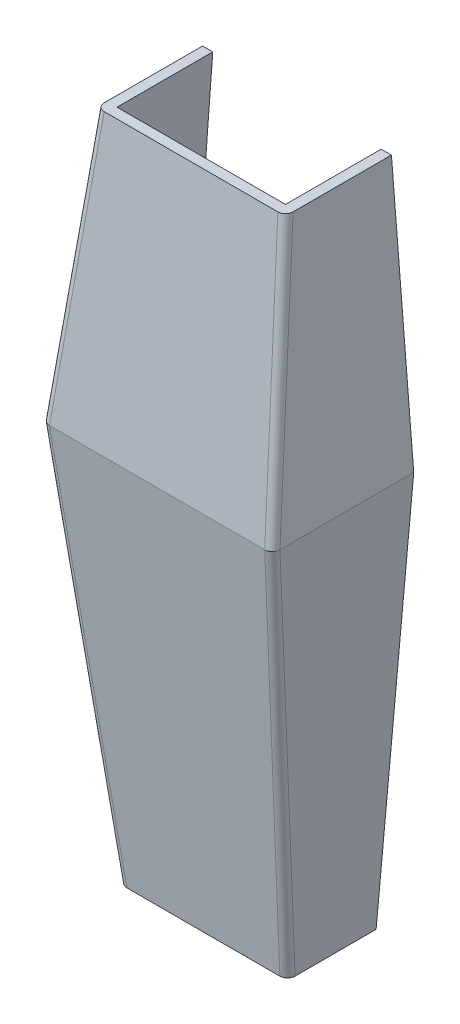
ISO-10303-21;
HEADER;
FILE_DESCRIPTION(('STEP AP214'),'2;1');
FILE_NAME('part.step','',(''),(''),'','','');
FILE_SCHEMA(('AUTOMOTIVE_DESIGN { 1 0 10303 214 1 1 1 1 }'));
ENDSEC;
DATA;
#1=APPLICATION_CONTEXT('core data for automotive mechanical design processes');
#2=APPLICATION_PROTOCOL_DEFINITION('international standard','automotive_design',2000,#1);
#3=PRODUCT_CONTEXT('',#1,'mechanical');
#4=PRODUCT('Part','Part','',(#3));
#5=PRODUCT_RELATED_PRODUCT_CATEGORY('part','',(#4));
#6=PRODUCT_DEFINITION_FORMATION('','',#4);
#7=PRODUCT_DEFINITION_CONTEXT('part definition',#1,'design');
#8=PRODUCT_DEFINITION('design','',#6,#7);
#9=PRODUCT_DEFINITION_SHAPE('','',#8);
#10=(LENGTH_UNIT() NAMED_UNIT(*) SI_UNIT(.MILLI.,.METRE.));
#11=(NAMED_UNIT(*) PLANE_ANGLE_UNIT() SI_UNIT($,.RADIAN.));
#12=(NAMED_UNIT(*) SI_UNIT($,.STERADIAN.) SOLID_ANGLE_UNIT());
#13=UNCERTAINTY_MEASURE_WITH_UNIT(LENGTH_MEASURE(1.E-05),#10,'distance_accuracy_value','');
#14=(GEOMETRIC_REPRESENTATION_CONTEXT(3) GLOBAL_UNCERTAINTY_ASSIGNED_CONTEXT((#13)) GLOBAL_UNIT_ASSIGNED_CONTEXT((#10,
#11,#12)) REPRESENTATION_CONTEXT('',''));
#15=CARTESIAN_POINT('',(0.,0.,0.));
#16=DIRECTION('',(0.,0.,1.));
#17=DIRECTION('',(1.,0.,0.));
#18=AXIS2_PLACEMENT_3D('',#15,#16,#17);
#19=CARTESIAN_POINT('',(0.,52.,0.));
#20=DIRECTION('',(0.,-1.,0.));
#21=DIRECTION('',(0.,0.,-1.));
#22=AXIS2_PLACEMENT_3D('',#19,#20,#21);
#23=PLANE('',#22);
#24=DIRECTION('',(1.,0.,0.));
#25=VECTOR('',#24,1.);
#26=CARTESIAN_POINT('',(-18.5188755077592,52.,8.99422683165892));
#27=LINE('',#26,#25);
#28=CARTESIAN_POINT('',(-17.0291924911233,52.,8.99422683165892));
#29=VERTEX_POINT('',#28);
#30=CARTESIAN_POINT('',(17.0291924911233,52.,8.99422683165892));
#31=VERTEX_POINT('',#30);
#32=EDGE_CURVE('E316',#29,#31,#27,.T.);
#33=ORIENTED_EDGE('',*,*,#32,.T.);
#34=CARTESIAN_POINT('',(17.0142688989289,52.,7.48201110743316));
#35=DIRECTION('',(0.,-1.,0.));
#36=DIRECTION('',(0.52281566203321,0.,0.852445765742769));
#37=AXIS2_PLACEMENT_3D('',#34,#35,#36);
#38=ELLIPSE('',#37,1.51678523329158,1.5);
#39=CARTESIAN_POINT('',(18.5188755077592,52.,7.49701017140502));
#40=VERTEX_POINT('',#39);
#41=EDGE_CURVE('E63',#31,#40,#38,.F.);
#42=ORIENTED_EDGE('',*,*,#41,.T.);
#43=DIRECTION('',(0.,0.,-1.));
#44=VECTOR('',#43,1.);
#45=CARTESIAN_POINT('',(18.5188755077592,52.,8.99422683165892));
#46=LINE('',#45,#44);
#47=CARTESIAN_POINT('',(18.5188755077592,52.,-11.7887815558452));
#48=VERTEX_POINT('',#47);
#49=EDGE_CURVE('E57',#40,#48,#46,.T.);
#50=ORIENTED_EDGE('',*,*,#49,.T.);
#51=DIRECTION('',(-1.,0.,0.));
#52=VECTOR('',#51,1.);
#53=CARTESIAN_POINT('',(-18.5188755077592,52.,-11.7887815558452));
#54=LINE('',#53,#52);
#55=CARTESIAN_POINT('',(16.5127333626522,52.,-11.7887815558452));
#56=VERTEX_POINT('',#55);
#57=EDGE_CURVE('E581',#48,#56,#54,.T.);
#58=ORIENTED_EDGE('',*,*,#57,.T.);
#59=DIRECTION('',(0.,0.,-1.));
#60=VECTOR('',#59,1.);
#61=CARTESIAN_POINT('',(16.5127333626522,52.,0.));
#62=LINE('',#61,#60);
#63=CARTESIAN_POINT('',(16.5127333626522,52.,6.97793919935791));
#64=VERTEX_POINT('',#63);
#65=EDGE_CURVE('E205',#64,#56,#62,.T.);
#66=ORIENTED_EDGE('',*,*,#65,.F.);
#67=DIRECTION('',(1.,0.,0.));
#68=VECTOR('',#67,1.);
#69=CARTESIAN_POINT('',(0.,52.,6.97793919935791));
#70=LINE('',#69,#68);
#71=CARTESIAN_POINT('',(-16.5127333626522,52.,6.97793919935791));
#72=VERTEX_POINT('',#71);
#73=EDGE_CURVE('E204',#72,#64,#70,.T.);
#74=ORIENTED_EDGE('',*,*,#73,.F.);
#75=DIRECTION('',(0.,0.,1.));
#76=VECTOR('',#75,1.);
#77=CARTESIAN_POINT('',(-16.5127333626522,52.,0.));
#78=LINE('',#77,#76);
#79=CARTESIAN_POINT('',(-16.5127333626522,52.,-11.7887815558452));
#80=VERTEX_POINT('',#79);
#81=EDGE_CURVE('E235',#80,#72,#78,.T.);
#82=ORIENTED_EDGE('',*,*,#81,.F.);
#83=CARTESIAN_POINT('',(-18.5188755077592,52.,-11.7887815558452));
#84=VERTEX_POINT('',#83);
#85=EDGE_CURVE('E368',#80,#84,#54,.T.);
#86=ORIENTED_EDGE('',*,*,#85,.T.);
#87=DIRECTION('',(0.,0.,1.));
#88=VECTOR('',#87,1.);
#89=CARTESIAN_POINT('',(-18.5188755077592,52.,8.99422683165892));
#90=LINE('',#89,#88);
#91=CARTESIAN_POINT('',(-18.5188755077592,52.,7.49701017140502));
#92=VERTEX_POINT('',#91);
#93=EDGE_CURVE('E577',#84,#92,#90,.T.);
#94=ORIENTED_EDGE('',*,*,#93,.T.);
#95=CARTESIAN_POINT('',(-17.0142688989289,52.,7.48201110743316));
#96=DIRECTION('',(0.,-1.,0.));
#97=DIRECTION('',(-0.52281566203321,0.,0.85244576574277));
#98=AXIS2_PLACEMENT_3D('',#95,#96,#97);
#99=ELLIPSE('',#98,1.51678523329158,1.5);
#100=EDGE_CURVE('E497',#92,#29,#99,.F.);
#101=ORIENTED_EDGE('',*,*,#100,.T.);
#102=EDGE_LOOP('',(#33,#42,#50,#58,#66,#74,#82,#86,#94,#101));
#103=FACE_BOUND('',#102,.T.);
#104=ADVANCED_FACE('F52',(#103),#23,.F.);
#105=CARTESIAN_POINT('',(0.,0.0676591543403054,-12.0796588325334));
#106=DIRECTION('',(0.,0.0056009937033721,-0.999984314311747));
#107=DIRECTION('',(0.,0.999984314311747,0.0056009937033721));
#108=AXIS2_PLACEMENT_3D('',#105,#106,#107);
#109=PLANE('',#108);
#110=ORIENTED_EDGE('',*,*,#85,.F.);
#111=DIRECTION('',(-0.0781906352049779,-0.996922787999062,-0.00558384584479609));
#112=VECTOR('',#111,1.);
#113=CARTESIAN_POINT('',(-20.460032538833,1.67232981969582,-12.0706709412595));
#114=LINE('',#113,#112);
#115=CARTESIAN_POINT('',(-20.5913000880713,-0.00045936157015178,-12.0800305192456));
#116=VERTEX_POINT('',#115);
#117=EDGE_CURVE('E212',#80,#116,#114,.T.);
#118=ORIENTED_EDGE('',*,*,#117,.T.);
#119=DIRECTION('',(-1.,0.,0.));
#120=VECTOR('',#119,1.);
#121=CARTESIAN_POINT('',(-22.5973388347132,0.,-12.0800377969752));
#122=LINE('',#121,#120);
#123=CARTESIAN_POINT('',(-22.5973388347132,0.,-12.0800377969752));
#124=VERTEX_POINT('',#123);
#125=EDGE_CURVE('E424',#116,#124,#122,.T.);
#126=ORIENTED_EDGE('',*,*,#125,.T.);
#127=DIRECTION('',(-0.0781906352049779,-0.996922787999062,-0.00558384584479609));
#128=VECTOR('',#127,1.);
#129=CARTESIAN_POINT('',(-18.5188755077592,52.,-11.7887815558452));
#130=LINE('',#129,#128);
#131=EDGE_CURVE('E673',#84,#124,#130,.T.);
#132=ORIENTED_EDGE('',*,*,#131,.F.);
#133=EDGE_LOOP('',(#110,#118,#126,#132));
#134=FACE_BOUND('',#133,.T.);
#135=ADVANCED_FACE('F335',(#134),#109,.T.);
#136=CARTESIAN_POINT('',(0.,-80.,0.));
#137=DIRECTION('',(0.,-1.,0.));
#138=DIRECTION('',(0.,0.,-1.));
#139=AXIS2_PLACEMENT_3D('',#136,#137,#138);
#140=PLANE('',#139);
#141=DIRECTION('',(1.,0.,0.));
#142=VECTOR('',#141,1.);
#143=CARTESIAN_POINT('',(-16.4895732274601,-80.,6.57189908788443));
#144=LINE('',#143,#142);
#145=CARTESIAN_POINT('',(-14.9981121668629,-80.,6.57189908788443));
#146=VERTEX_POINT('',#145);
#147=CARTESIAN_POINT('',(14.9981121668629,-80.,6.57189908788443));
#148=VERTEX_POINT('',#147);
#149=EDGE_CURVE('E461',#146,#148,#144,.T.);
#150=ORIENTED_EDGE('',*,*,#149,.F.);
#151=CARTESIAN_POINT('',(-14.9852079230873,-80.,5.06228475793314));
#152=DIRECTION('',(0.,-1.,0.));
#153=DIRECTION('',(-0.55846839253135,0.,0.829525801011307));
#154=AXIS2_PLACEMENT_3D('',#151,#152,#153);
#155=ELLIPSE('',#154,1.51395191277496,1.5);
#156=CARTESIAN_POINT('',(-16.4895732274601,-80.,5.07523402714601));
#157=VERTEX_POINT('',#156);
#158=EDGE_CURVE('E609',#146,#157,#155,.T.);
#159=ORIENTED_EDGE('',*,*,#158,.T.);
#160=DIRECTION('',(0.,0.,1.));
#161=VECTOR('',#160,1.);
#162=CARTESIAN_POINT('',(-16.4895732274601,-80.,6.57189908788443));
#163=LINE('',#162,#161);
#164=CARTESIAN_POINT('',(-16.4895732274601,-80.,-10.8125866142183));
#165=VERTEX_POINT('',#164);
#166=EDGE_CURVE('E466',#165,#157,#163,.T.);
#167=ORIENTED_EDGE('',*,*,#166,.F.);
#168=DIRECTION('',(-1.,0.,0.));
#169=VECTOR('',#168,1.);
#170=CARTESIAN_POINT('',(-16.4895732274601,-80.,-10.8125866142183));
#171=LINE('',#170,#169);
#172=CARTESIAN_POINT('',(-14.4837528216297,-80.,-10.8125866142183));
#173=VERTEX_POINT('',#172);
#174=EDGE_CURVE('E669',#173,#165,#171,.T.);
#175=ORIENTED_EDGE('',*,*,#174,.F.);
#176=DIRECTION('',(0.,0.,1.));
#177=VECTOR('',#176,1.);
#178=CARTESIAN_POINT('',(-14.4837528216297,-80.,0.));
#179=LINE('',#178,#177);
#180=CARTESIAN_POINT('',(-14.4837528216297,-80.,4.55907998128272));
#181=VERTEX_POINT('',#180);
#182=EDGE_CURVE('E244',#173,#181,#179,.T.);
#183=ORIENTED_EDGE('',*,*,#182,.T.);
#184=DIRECTION('',(1.,0.,0.));
#185=VECTOR('',#184,1.);
#186=CARTESIAN_POINT('',(0.,-80.,4.55907998128272));
#187=LINE('',#186,#185);
#188=CARTESIAN_POINT('',(14.4837528216297,-80.,4.55907998128272));
#189=VERTEX_POINT('',#188);
#190=EDGE_CURVE('E186',#181,#189,#187,.T.);
#191=ORIENTED_EDGE('',*,*,#190,.T.);
#192=DIRECTION('',(0.,0.,-1.));
#193=VECTOR('',#192,1.);
#194=CARTESIAN_POINT('',(14.4837528216297,-80.,0.));
#195=LINE('',#194,#193);
#196=CARTESIAN_POINT('',(14.4837528216297,-80.,-10.8125866142183));
#197=VERTEX_POINT('',#196);
#198=EDGE_CURVE('E192',#189,#197,#195,.T.);
#199=ORIENTED_EDGE('',*,*,#198,.T.);
#200=CARTESIAN_POINT('',(16.4895732274601,-80.,-10.8125866142183));
#201=VERTEX_POINT('',#200);
#202=EDGE_CURVE('E667',#201,#197,#171,.T.);
#203=ORIENTED_EDGE('',*,*,#202,.F.);
#204=DIRECTION('',(0.,0.,-1.));
#205=VECTOR('',#204,1.);
#206=CARTESIAN_POINT('',(16.4895732274601,-80.,6.57189908788443));
#207=LINE('',#206,#205);
#208=CARTESIAN_POINT('',(16.4895732274601,-80.,5.07523402714601));
#209=VERTEX_POINT('',#208);
#210=EDGE_CURVE('E467',#209,#201,#207,.T.);
#211=ORIENTED_EDGE('',*,*,#210,.F.);
#212=CARTESIAN_POINT('',(14.9852079230873,-80.,5.06228475793315));
#213=DIRECTION('',(0.,-1.,0.));
#214=DIRECTION('',(0.558468392531351,0.,0.829525801011306));
#215=AXIS2_PLACEMENT_3D('',#212,#213,#214);
#216=ELLIPSE('',#215,1.51395191277496,1.5);
#217=EDGE_CURVE('E611',#209,#148,#216,.T.);
#218=ORIENTED_EDGE('',*,*,#217,.T.);
#219=EDGE_LOOP('',(#150,#159,#167,#175,#183,#191,#199,#203,#211,#218));
#220=FACE_BOUND('',#219,.T.);
#221=ADVANCED_FACE('F637',(#220),#140,.T.);
#222=CARTESIAN_POINT('',(0.,-0.191337700684521,-12.0770064070372));
#223=DIRECTION('',(0.,0.0158411518044274,0.999874521082275));
#224=DIRECTION('',(0.,-0.999874521082275,0.0158411518044274));
#225=AXIS2_PLACEMENT_3D('',#222,#223,#224);
#226=PLANE('',#225);
#227=DIRECTION('',(-0.0761160325494471,0.996973851898427,-0.0157951960970792));
#228=VECTOR('',#227,1.);
#229=CARTESIAN_POINT('',(-20.4576949308948,-1.75283082676267,-12.0522674531683));
#230=LINE('',#229,#228);
#231=EDGE_CURVE('E228',#173,#116,#230,.T.);
#232=ORIENTED_EDGE('',*,*,#231,.F.);
#233=ORIENTED_EDGE('',*,*,#174,.T.);
#234=DIRECTION('',(-0.076116032549447,0.996973851898427,-0.0157951960970792));
#235=VECTOR('',#234,1.);
#236=CARTESIAN_POINT('',(-16.4895732274601,-80.,-10.8125866142183));
#237=LINE('',#236,#235);
#238=EDGE_CURVE('E889',#165,#124,#237,.T.);
#239=ORIENTED_EDGE('',*,*,#238,.T.);
#240=ORIENTED_EDGE('',*,*,#125,.F.);
#241=EDGE_LOOP('',(#232,#233,#239,#240));
#242=FACE_BOUND('',#241,.T.);
#243=ADVANCED_FACE('F646',(#242),#226,.F.);
#244=CARTESIAN_POINT('',(0.,1.96841909915263,15.3923944347321));
#245=DIRECTION('',(0.,0.126849539789616,0.991921969841964));
#246=DIRECTION('',(0.,-0.991921969841964,0.126849539789616));
#247=AXIS2_PLACEMENT_3D('',#244,#245,#246);
#248=PLANE('',#247);
#249=CARTESIAN_POINT('',(21.5706429368671,6.25655190119919,14.8440169523955));
#250=DIRECTION('',(0.,0.126849539789616,0.991921969841964));
#251=DIRECTION('',(0.0778643538226336,0.988910457484795,-0.126464419822328));
#252=AXIS2_PLACEMENT_3D('',#249,#250,#251);
#253=ELLIPSE('',#252,6.32562749447484,1.5);
#254=CARTESIAN_POINT('',(21.1058777741159,0.,15.6441209459217));
#255=VERTEX_POINT('',#254);
#256=CARTESIAN_POINT('',(21.1076558180773,0.,15.6441209459217));
#257=VERTEX_POINT('',#256);
#258=EDGE_CURVE('E553',#255,#257,#253,.T.);
#259=ORIENTED_EDGE('',*,*,#258,.T.);
#260=DIRECTION('',(0.0775640334590426,-0.988933678332855,0.126467389364268));
#261=VECTOR('',#260,1.);
#262=CARTESIAN_POINT('',(20.8272101750519,3.57565393341664,15.1868570988743));
#263=LINE('',#262,#261);
#264=EDGE_CURVE('E573',#257,#31,#263,.F.);
#265=ORIENTED_EDGE('',*,*,#264,.T.);
#266=ORIENTED_EDGE('',*,*,#32,.F.);
#267=DIRECTION('',(-0.0775640334590425,-0.988933678332855,0.126467389364268));
#268=VECTOR('',#267,1.);
#269=CARTESIAN_POINT('',(-20.8272101750519,3.57565393341664,15.1868570988743));
#270=LINE('',#269,#268);
#271=CARTESIAN_POINT('',(-21.1076558180773,0.,15.6441209459217));
#272=VERTEX_POINT('',#271);
#273=EDGE_CURVE('E554',#29,#272,#270,.T.);
#274=ORIENTED_EDGE('',*,*,#273,.T.);
#275=CARTESIAN_POINT('',(-21.5706429368671,6.2565519011992,14.8440169523955));
#276=DIRECTION('',(0.,0.126849539789616,0.991921969841964));
#277=DIRECTION('',(-0.0778643538226335,0.988910457484795,-0.126464419822328));
#278=AXIS2_PLACEMENT_3D('',#275,#276,#277);
#279=ELLIPSE('',#278,6.32562749447484,1.5);
#280=CARTESIAN_POINT('',(-21.1058777741159,0.,15.6441209459217));
#281=VERTEX_POINT('',#280);
#282=EDGE_CURVE('E546',#272,#281,#279,.T.);
#283=ORIENTED_EDGE('',*,*,#282,.T.);
#284=DIRECTION('',(1.,0.,0.));
#285=VECTOR('',#284,1.);
#286=CARTESIAN_POINT('',(-22.5973388347132,0.,15.6441209459217));
#287=LINE('',#286,#285);
#288=EDGE_CURVE('E309',#281,#255,#287,.T.);
#289=ORIENTED_EDGE('',*,*,#288,.T.);
#290=EDGE_LOOP('',(#259,#265,#266,#274,#283,#289));
#291=FACE_BOUND('',#290,.T.);
#292=ADVANCED_FACE('F338',(#291),#248,.T.);
#293=CARTESIAN_POINT('',(22.4591794719602,1.76151807365128,0.));
#294=DIRECTION('',(0.996938330057005,0.0781918541994653,0.));
#295=DIRECTION('',(-0.0781918541994654,0.996938330057005,0.));
#296=AXIS2_PLACEMENT_3D('',#293,#294,#295);
#297=PLANE('',#296);
#298=ORIENTED_EDGE('',*,*,#49,.F.);
#299=DIRECTION('',(0.0775640334590426,-0.988933678332855,0.126467389364268));
#300=VECTOR('',#299,1.);
#301=CARTESIAN_POINT('',(22.3226176701374,3.50266740503142,13.6989741441113));
#302=LINE('',#301,#300);
#303=CARTESIAN_POINT('',(22.5973388347132,0.,14.1469042856678));
#304=VERTEX_POINT('',#303);
#305=EDGE_CURVE('E848',#40,#304,#302,.T.);
#306=ORIENTED_EDGE('',*,*,#305,.T.);
#307=DIRECTION('',(0.,0.,-1.));
#308=VECTOR('',#307,1.);
#309=CARTESIAN_POINT('',(22.5973388347132,0.,15.6441209459217));
#310=LINE('',#309,#308);
#311=CARTESIAN_POINT('',(22.5973388347132,0.,-12.0800377969752));
#312=VERTEX_POINT('',#311);
#313=EDGE_CURVE('E465',#304,#312,#310,.T.);
#314=ORIENTED_EDGE('',*,*,#313,.T.);
#315=DIRECTION('',(0.078190635204978,-0.996922787999062,-0.00558384584479609));
#316=VECTOR('',#315,1.);
#317=CARTESIAN_POINT('',(18.5188755077592,52.,-11.7887815558452));
#318=LINE('',#317,#316);
#319=EDGE_CURVE('E386',#48,#312,#318,.T.);
#320=ORIENTED_EDGE('',*,*,#319,.F.);
#321=EDGE_LOOP('',(#298,#306,#314,#320));
#322=FACE_BOUND('',#321,.T.);
#323=ADVANCED_FACE('F707',(#322),#297,.T.);
#324=CARTESIAN_POINT('',(-22.4591794719602,1.76151807365128,0.));
#325=DIRECTION('',(-0.996938330057005,0.0781918541994653,0.));
#326=DIRECTION('',(-0.0781918541994653,-0.996938330057005,0.));
#327=AXIS2_PLACEMENT_3D('',#324,#325,#326);
#328=PLANE('',#327);
#329=DIRECTION('',(0.,0.,1.));
#330=VECTOR('',#329,1.);
#331=CARTESIAN_POINT('',(-22.5973388347132,0.,15.6441209459217));
#332=LINE('',#331,#330);
#333=CARTESIAN_POINT('',(-22.5973388347132,0.,14.1469042856678));
#334=VERTEX_POINT('',#333);
#335=EDGE_CURVE('E446',#124,#334,#332,.T.);
#336=ORIENTED_EDGE('',*,*,#335,.T.);
#337=DIRECTION('',(-0.0775640334590425,-0.988933678332855,0.126467389364268));
#338=VECTOR('',#337,1.);
#339=CARTESIAN_POINT('',(-22.3226176701374,3.50266740503141,13.6989741441113));
#340=LINE('',#339,#338);
#341=EDGE_CURVE('E12',#334,#92,#340,.F.);
#342=ORIENTED_EDGE('',*,*,#341,.T.);
#343=ORIENTED_EDGE('',*,*,#93,.F.);
#344=ORIENTED_EDGE('',*,*,#131,.T.);
#345=EDGE_LOOP('',(#336,#342,#343,#344));
#346=FACE_BOUND('',#345,.T.);
#347=ADVANCED_FACE('F399',(#346),#328,.T.);
#348=DIRECTION('',(0.0781906352049779,-0.996922787999062,-0.00558384584479608));
#349=VECTOR('',#348,1.);
#350=CARTESIAN_POINT('',(20.460032538833,1.67232981969582,-12.0706709412595));
#351=LINE('',#350,#349);
#352=CARTESIAN_POINT('',(20.5913000880713,-0.000459361570151871,-12.0800305192456));
#353=VERTEX_POINT('',#352);
#354=EDGE_CURVE('E182',#56,#353,#351,.T.);
#355=ORIENTED_EDGE('',*,*,#354,.F.);
#356=ORIENTED_EDGE('',*,*,#57,.F.);
#357=ORIENTED_EDGE('',*,*,#319,.T.);
#358=EDGE_CURVE('E376',#312,#353,#122,.T.);
#359=ORIENTED_EDGE('',*,*,#358,.T.);
#360=EDGE_LOOP('',(#355,#356,#357,#359));
#361=FACE_BOUND('',#360,.T.);
#362=ADVANCED_FACE('F389',(#361),#109,.T.);
#363=CARTESIAN_POINT('',(22.4663850818657,-1.71524267652902,0.));
#364=DIRECTION('',(-0.997098241789992,0.076125529353217,0.));
#365=DIRECTION('',(-0.076125529353217,-0.997098241789992,0.));
#366=AXIS2_PLACEMENT_3D('',#363,#364,#365);
#367=PLANE('',#366);
#368=ORIENTED_EDGE('',*,*,#313,.F.);
#369=CARTESIAN_POINT('',(21.8551692651325,-9.72099608667819,15.3750512728801));
#370=DIRECTION('',(-0.997098241789992,0.076125529353217,0.));
#371=DIRECTION('',(-0.0754996619748789,-0.988900581059923,0.127966565246656));
#372=AXIS2_PLACEMENT_3D('',#369,#370,#371);
#373=ELLIPSE('',#372,9.82819907379263,1.5);
#374=CARTESIAN_POINT('',(22.5973388347132,0.,14.1474558851833));
#375=VERTEX_POINT('',#374);
#376=EDGE_CURVE('E485',#304,#375,#373,.F.);
#377=ORIENTED_EDGE('',*,*,#376,.T.);
#378=DIRECTION('',(0.0756434891819556,0.990784441264458,0.112357703308033));
#379=VECTOR('',#378,1.);
#380=CARTESIAN_POINT('',(22.3477972266839,-3.26851584131445,13.7767971244469));
#381=LINE('',#380,#379);
#382=EDGE_CURVE('E498',#375,#209,#381,.F.);
#383=ORIENTED_EDGE('',*,*,#382,.T.);
#384=ORIENTED_EDGE('',*,*,#210,.T.);
#385=DIRECTION('',(0.0761160325494471,0.996973851898427,-0.0157951960970792));
#386=VECTOR('',#385,1.);
#387=CARTESIAN_POINT('',(16.4895732274601,-80.,-10.8125866142183));
#388=LINE('',#387,#386);
#389=EDGE_CURVE('E888',#201,#312,#388,.T.);
#390=ORIENTED_EDGE('',*,*,#389,.T.);
#391=EDGE_LOOP('',(#368,#377,#383,#384,#390));
#392=FACE_BOUND('',#391,.T.);
#393=ADVANCED_FACE('F281',(#392),#367,.F.);
#394=CARTESIAN_POINT('',(0.,-1.7515612907415,15.4454890380773));
#395=DIRECTION('',(0.,0.112680541290098,-0.993631267430011));
#396=DIRECTION('',(0.,0.993631267430011,0.112680541290098));
#397=AXIS2_PLACEMENT_3D('',#394,#395,#396);
#398=PLANE('',#397);
#399=ORIENTED_EDGE('',*,*,#288,.F.);
#400=DIRECTION('',(-0.0756434891819555,0.990784441264458,0.112357703308033));
#401=VECTOR('',#400,1.);
#402=CARTESIAN_POINT('',(-20.8521498639989,-3.32334835921977,15.2672440255919));
#403=LINE('',#402,#401);
#404=EDGE_CURVE('E608',#281,#146,#403,.F.);
#405=ORIENTED_EDGE('',*,*,#404,.T.);
#406=ORIENTED_EDGE('',*,*,#149,.T.);
#407=DIRECTION('',(0.0756434891819556,0.990784441264458,0.112357703308033));
#408=VECTOR('',#407,1.);
#409=CARTESIAN_POINT('',(20.8521498639989,-3.32334835921977,15.2672440255919));
#410=LINE('',#409,#408);
#411=EDGE_CURVE('E612',#148,#255,#410,.T.);
#412=ORIENTED_EDGE('',*,*,#411,.T.);
#413=EDGE_LOOP('',(#399,#405,#406,#412));
#414=FACE_BOUND('',#413,.T.);
#415=ADVANCED_FACE('F271',(#414),#398,.F.);
#416=ORIENTED_EDGE('',*,*,#202,.T.);
#417=DIRECTION('',(0.0761160325494472,0.996973851898427,-0.0157951960970792));
#418=VECTOR('',#417,1.);
#419=CARTESIAN_POINT('',(20.4576949308948,-1.75283082676267,-12.0522674531683));
#420=LINE('',#419,#418);
#421=EDGE_CURVE('E196',#197,#353,#420,.T.);
#422=ORIENTED_EDGE('',*,*,#421,.T.);
#423=ORIENTED_EDGE('',*,*,#358,.F.);
#424=ORIENTED_EDGE('',*,*,#389,.F.);
#425=EDGE_LOOP('',(#416,#422,#423,#424));
#426=FACE_BOUND('',#425,.T.);
#427=ADVANCED_FACE('F280',(#426),#226,.F.);
#428=CARTESIAN_POINT('',(-22.4663850818657,-1.71524267652902,0.));
#429=DIRECTION('',(0.997098241789992,0.0761255293532169,0.));
#430=DIRECTION('',(-0.0761255293532169,0.997098241789992,0.));
#431=AXIS2_PLACEMENT_3D('',#428,#429,#430);
#432=PLANE('',#431);
#433=ORIENTED_EDGE('',*,*,#166,.T.);
#434=DIRECTION('',(-0.0756434891819555,0.990784441264458,0.112357703308033));
#435=VECTOR('',#434,1.);
#436=CARTESIAN_POINT('',(-22.3477972266839,-3.26851584131445,13.7767971244469));
#437=LINE('',#436,#435);
#438=CARTESIAN_POINT('',(-22.5973388347132,0.,14.1474558851833));
#439=VERTEX_POINT('',#438);
#440=EDGE_CURVE('E579',#157,#439,#437,.T.);
#441=ORIENTED_EDGE('',*,*,#440,.T.);
#442=CARTESIAN_POINT('',(-21.8551692651325,-9.72099608667818,15.3750512728801));
#443=DIRECTION('',(0.997098241789992,0.0761255293532169,0.));
#444=DIRECTION('',(0.0754996619748789,-0.988900581059923,0.127966565246656));
#445=AXIS2_PLACEMENT_3D('',#442,#443,#444);
#446=ELLIPSE('',#445,9.82819907379264,1.5);
#447=EDGE_CURVE('E576',#439,#334,#446,.F.);
#448=ORIENTED_EDGE('',*,*,#447,.T.);
#449=ORIENTED_EDGE('',*,*,#335,.F.);
#450=ORIENTED_EDGE('',*,*,#238,.F.);
#451=EDGE_LOOP('',(#433,#441,#448,#449,#450));
#452=FACE_BOUND('',#451,.T.);
#453=ADVANCED_FACE('F336',(#452),#432,.F.);
#454=CARTESIAN_POINT('',(0.,1.7147200195734,13.4085504950482));
#455=DIRECTION('',(0.,0.126849539789616,0.991921969841964));
#456=DIRECTION('',(0.,-0.991921969841964,0.126849539789616));
#457=AXIS2_PLACEMENT_3D('',#454,#455,#456);
#458=PLANE('',#457);
#459=DIRECTION('',(-0.0775640334590425,-0.988933678332855,0.126467389364268));
#460=VECTOR('',#459,1.);
#461=CARTESIAN_POINT('',(-20.3336365695426,3.28386580180498,13.2078840854005));
#462=LINE('',#461,#460);
#463=CARTESIAN_POINT('',(-20.5908903252625,-0.0082269512040326,13.628885397359));
#464=VERTEX_POINT('',#463);
#465=EDGE_CURVE('E206',#72,#464,#462,.T.);
#466=ORIENTED_EDGE('',*,*,#465,.F.);
#467=ORIENTED_EDGE('',*,*,#73,.T.);
#468=DIRECTION('',(0.0775640334590426,-0.988933678332855,0.126467389364268));
#469=VECTOR('',#468,1.);
#470=CARTESIAN_POINT('',(20.3336365695426,3.28386580180498,13.2078840854005));
#471=LINE('',#470,#469);
#472=CARTESIAN_POINT('',(20.5908903252625,-0.00822695120403357,13.628885397359));
#473=VERTEX_POINT('',#472);
#474=EDGE_CURVE('E179',#64,#473,#471,.T.);
#475=ORIENTED_EDGE('',*,*,#474,.T.);
#476=DIRECTION('',(1.,0.,0.));
#477=VECTOR('',#476,1.);
#478=CARTESIAN_POINT('',(0.,-0.0143752020815454,13.6296716515383));
#479=LINE('',#478,#477);
#480=EDGE_CURVE('E201',#464,#473,#479,.T.);
#481=ORIENTED_EDGE('',*,*,#480,.F.);
#482=EDGE_LOOP('',(#466,#467,#475,#481));
#483=FACE_BOUND('',#482,.T.);
#484=ADVANCED_FACE('F200',(#483),#458,.F.);
#485=CARTESIAN_POINT('',(20.4653028118462,1.60513436525235,0.));
#486=DIRECTION('',(0.996938330057005,0.0781918541994653,0.));
#487=DIRECTION('',(-0.0781918541994654,0.996938330057005,0.));
#488=AXIS2_PLACEMENT_3D('',#485,#486,#487);
#489=PLANE('',#488);
#490=ORIENTED_EDGE('',*,*,#474,.F.);
#491=ORIENTED_EDGE('',*,*,#65,.T.);
#492=ORIENTED_EDGE('',*,*,#354,.T.);
#493=DIRECTION('',(0.,0.,-1.));
#494=VECTOR('',#493,1.);
#495=CARTESIAN_POINT('',(20.5913597262032,-0.00207870032651984,0.));
#496=LINE('',#495,#494);
#497=EDGE_CURVE('E175',#473,#353,#496,.T.);
#498=ORIENTED_EDGE('',*,*,#497,.F.);
#499=EDGE_LOOP('',(#490,#491,#492,#498));
#500=FACE_BOUND('',#499,.T.);
#501=ADVANCED_FACE('F177',(#500),#489,.F.);
#502=CARTESIAN_POINT('',(-20.4653028118462,1.60513436525235,0.));
#503=DIRECTION('',(-0.996938330057005,0.0781918541994653,0.));
#504=DIRECTION('',(-0.0781918541994653,-0.996938330057005,0.));
#505=AXIS2_PLACEMENT_3D('',#502,#503,#504);
#506=PLANE('',#505);
#507=ORIENTED_EDGE('',*,*,#117,.F.);
#508=ORIENTED_EDGE('',*,*,#81,.T.);
#509=ORIENTED_EDGE('',*,*,#465,.T.);
#510=DIRECTION('',(0.,0.,1.));
#511=VECTOR('',#510,1.);
#512=CARTESIAN_POINT('',(-20.5913597262032,-0.00207870032651984,0.));
#513=LINE('',#512,#511);
#514=EDGE_CURVE('E185',#116,#464,#513,.T.);
#515=ORIENTED_EDGE('',*,*,#514,.F.);
#516=EDGE_LOOP('',(#507,#508,#509,#515));
#517=FACE_BOUND('',#516,.T.);
#518=ADVANCED_FACE('F754',(#517),#506,.F.);
#519=CARTESIAN_POINT('',(20.4721885982857,-1.56299161782258,0.));
#520=DIRECTION('',(-0.997098241789992,0.076125529353217,0.));
#521=DIRECTION('',(-0.076125529353217,-0.997098241789992,0.));
#522=AXIS2_PLACEMENT_3D('',#519,#520,#521);
#523=PLANE('',#522);
#524=ORIENTED_EDGE('',*,*,#421,.F.);
#525=ORIENTED_EDGE('',*,*,#198,.F.);
#526=DIRECTION('',(0.0756434891819556,0.990784441264458,0.112357703308033));
#527=VECTOR('',#526,1.);
#528=CARTESIAN_POINT('',(20.3578408594352,-3.06072740145774,13.2842068639075));
#529=LINE('',#528,#527);
#530=EDGE_CURVE('E189',#189,#473,#529,.T.);
#531=ORIENTED_EDGE('',*,*,#530,.T.);
#532=ORIENTED_EDGE('',*,*,#497,.T.);
#533=EDGE_LOOP('',(#524,#525,#531,#532));
#534=FACE_BOUND('',#533,.T.);
#535=ADVANCED_FACE('F190',(#534),#523,.T.);
#536=CARTESIAN_POINT('',(0.,-1.5262002081613,13.4582265032172));
#537=DIRECTION('',(0.,0.112680541290098,-0.993631267430011));
#538=DIRECTION('',(0.,0.993631267430011,0.112680541290098));
#539=AXIS2_PLACEMENT_3D('',#536,#537,#538);
#540=PLANE('',#539);
#541=ORIENTED_EDGE('',*,*,#530,.F.);
#542=ORIENTED_EDGE('',*,*,#190,.F.);
#543=DIRECTION('',(-0.0756434891819555,0.990784441264458,0.112357703308033));
#544=VECTOR('',#543,1.);
#545=CARTESIAN_POINT('',(-20.3578408594352,-3.06072740145774,13.2842068639075));
#546=LINE('',#545,#544);
#547=EDGE_CURVE('E210',#181,#464,#546,.T.);
#548=ORIENTED_EDGE('',*,*,#547,.T.);
#549=ORIENTED_EDGE('',*,*,#480,.T.);
#550=EDGE_LOOP('',(#541,#542,#548,#549));
#551=FACE_BOUND('',#550,.T.);
#552=ADVANCED_FACE('F208',(#551),#540,.T.);
#553=CARTESIAN_POINT('',(-20.4721885982857,-1.56299161782258,0.));
#554=DIRECTION('',(0.997098241789992,0.0761255293532169,0.));
#555=DIRECTION('',(-0.0761255293532169,0.997098241789992,0.));
#556=AXIS2_PLACEMENT_3D('',#553,#554,#555);
#557=PLANE('',#556);
#558=ORIENTED_EDGE('',*,*,#547,.F.);
#559=ORIENTED_EDGE('',*,*,#182,.F.);
#560=ORIENTED_EDGE('',*,*,#231,.T.);
#561=ORIENTED_EDGE('',*,*,#514,.T.);
#562=EDGE_LOOP('',(#558,#559,#560,#561));
#563=FACE_BOUND('',#562,.T.);
#564=ADVANCED_FACE('F647',(#563),#557,.T.);
#565=CARTESIAN_POINT('',(-20.8272101750519,3.38537962373222,13.6989741441113));
#566=DIRECTION('',(-0.0775640334590425,-0.988933678332855,0.126467389364268));
#567=DIRECTION('',(0.,-0.126849539789616,-0.991921969841964));
#568=AXIS2_PLACEMENT_3D('',#565,#566,#567);
#569=CYLINDRICAL_SURFACE('',#568,1.5);
#570=ORIENTED_EDGE('',*,*,#341,.F.);
#571=ORIENTED_EDGE('',*,*,#447,.F.);
#572=CARTESIAN_POINT('',(-22.5973387853626,-6.46397492268195E-07,14.14745581188));
#573=CARTESIAN_POINT('',(-22.5973308185809,-9.75196907184661E-05,14.1898037529237));
#574=CARTESIAN_POINT('',(-22.5955495131469,-0.000149309161487672,14.2321318459891));
#575=CARTESIAN_POINT('',(-22.5884490416481,-0.000188854131629427,14.3164901961482));
#576=CARTESIAN_POINT('',(-22.5831298680072,-0.000176609493877319,14.3585204526041));
#577=CARTESIAN_POINT('',(-22.5618969750045,-8.31049678529187E-05,14.4836697467597));
#578=CARTESIAN_POINT('',(-22.5407078061515,5.48110923598974E-05,14.5659574001413));
#579=CARTESIAN_POINT('',(-22.4847738999457,0.000378705055900087,14.7258133522086));
#580=CARTESIAN_POINT('',(-22.4500193731905,0.000564717635148839,14.8033781958574));
#581=CARTESIAN_POINT('',(-22.3678978260998,0.000928104624078245,14.9515022064799));
#582=CARTESIAN_POINT('',(-22.3205347762321,0.00110548173233517,15.0220635692878));
#583=CARTESIAN_POINT('',(-22.2148859243069,0.00141250528669716,15.1536639409738));
#584=CARTESIAN_POINT('',(-22.1566777923741,0.00154247281790375,15.2147653302442));
#585=CARTESIAN_POINT('',(-22.0307581440161,0.00172908567726886,15.3262658959059));
#586=CARTESIAN_POINT('',(-21.9630449450712,0.00178571800596171,15.3766631735532));
#587=CARTESIAN_POINT('',(-21.8205089076968,0.00180364687616366,15.4650124431626));
#588=CARTESIAN_POINT('',(-21.7457310704636,0.00176551226660461,15.5030371515512));
#589=CARTESIAN_POINT('',(-21.5908665740004,0.00157604669805739,15.565972058465));
#590=CARTESIAN_POINT('',(-21.5107829760637,0.00142478050366109,15.5908897464877));
#591=CARTESIAN_POINT('',(-21.3764320145219,0.00106675536363404,15.6205998032061));
#592=CARTESIAN_POINT('',(-21.3230140130722,0.000898346489019778,15.629390059664));
#593=CARTESIAN_POINT('',(-21.2156232842647,0.000499520594021436,15.6411321893395));
#594=CARTESIAN_POINT('',(-21.1616515347976,0.000269199198327568,15.6440930079811));
#595=CARTESIAN_POINT('',(-21.1076554755597,4.36706522558098E-06,15.6441203874501));
#596=B_SPLINE_CURVE_WITH_KNOTS('',3,(#572,#573,#574,#575,#576,#577,#578,#579,#580,#581,#582,
#583,#584,#585,#586,#587,#588,#589,#590,#591,#592,#593,#594,#595),.UNSPECIFIED.,.F.,.F.,(4,2,2,
2,2,2,2,2,2,2,2,4),(0.,0.126967599470868,0.253935470834264,0.50754511059187,0.761338106418029,
1.01505127629084,1.26701276937874,1.51901891928243,1.76951603278559,2.01986985352734,
2.18198459771305,2.34385037811288),.UNSPECIFIED.);
#597=EDGE_CURVE('E229',#272,#439,#596,.F.);
#598=ORIENTED_EDGE('',*,*,#597,.F.);
#599=ORIENTED_EDGE('',*,*,#273,.F.);
#600=ORIENTED_EDGE('',*,*,#100,.F.);
#601=EDGE_LOOP('',(#570,#571,#598,#599,#600));
#602=FACE_BOUND('',#601,.T.);
#603=ADVANCED_FACE('F402',(#602),#569,.T.);
#604=CARTESIAN_POINT('',(-20.8521498639989,-3.15432754728463,13.7767971244469));
#605=DIRECTION('',(-0.0756434891819555,0.990784441264458,0.112357703308033));
#606=DIRECTION('',(0.,-0.112680541290098,0.993631267430011));
#607=AXIS2_PLACEMENT_3D('',#604,#605,#606);
#608=CYLINDRICAL_SURFACE('',#607,1.5);
#609=ORIENTED_EDGE('',*,*,#158,.F.);
#610=ORIENTED_EDGE('',*,*,#404,.F.);
#611=ORIENTED_EDGE('',*,*,#282,.F.);
#612=ORIENTED_EDGE('',*,*,#597,.T.);
#613=ORIENTED_EDGE('',*,*,#440,.F.);
#614=EDGE_LOOP('',(#609,#610,#611,#612,#613));
#615=FACE_BOUND('',#614,.T.);
#616=ADVANCED_FACE('F533',(#615),#608,.T.);
#617=CARTESIAN_POINT('',(20.8521498639989,-3.15432754728463,13.7767971244469));
#618=DIRECTION('',(0.0756434891819556,0.990784441264458,0.112357703308033));
#619=DIRECTION('',(0.,-0.112680541290098,0.993631267430011));
#620=AXIS2_PLACEMENT_3D('',#617,#618,#619);
#621=CYLINDRICAL_SURFACE('',#620,1.5);
#622=ORIENTED_EDGE('',*,*,#217,.F.);
#623=ORIENTED_EDGE('',*,*,#382,.F.);
#624=CARTESIAN_POINT('',(22.5973387853626,-6.46397514348726E-07,14.14745581188));
#625=CARTESIAN_POINT('',(22.5973308185809,-9.75196907543908E-05,14.1898037529237));
#626=CARTESIAN_POINT('',(22.5955495131469,-0.000149309161527892,14.2321318459891));
#627=CARTESIAN_POINT('',(22.5884490416481,-0.000188854131670101,14.3164901961482));
#628=CARTESIAN_POINT('',(22.5831298680072,-0.000176609493914153,14.3585204526041));
#629=CARTESIAN_POINT('',(22.5618969750045,-8.31049678824882E-05,14.4836697467597));
#630=CARTESIAN_POINT('',(22.5407078061515,5.48110923295197E-05,14.5659574001413));
#631=CARTESIAN_POINT('',(22.4847738999457,0.000378705055871408,14.7258133522086));
#632=CARTESIAN_POINT('',(22.4500193731905,0.000564717635122669,14.8033781958574));
#633=CARTESIAN_POINT('',(22.3678978260998,0.000928104624055066,14.9515022064799));
#634=CARTESIAN_POINT('',(22.3205347762321,0.00110548173231247,15.0220635692878));
#635=CARTESIAN_POINT('',(22.2148859243069,0.00141250528667692,15.1536639409738));
#636=CARTESIAN_POINT('',(22.1566777923741,0.00154247281788547,15.2147653302442));
#637=CARTESIAN_POINT('',(22.0307581440161,0.00172908567725413,15.3262658959059));
#638=CARTESIAN_POINT('',(21.9630449450712,0.00178571800594856,15.3766631735532));
#639=CARTESIAN_POINT('',(21.8205089076968,0.00180364687615269,15.4650124431626));
#640=CARTESIAN_POINT('',(21.7457310704636,0.00176551226659424,15.5030371515512));
#641=CARTESIAN_POINT('',(21.5908665740004,0.00157604669804961,15.565972058465));
#642=CARTESIAN_POINT('',(21.5107829760637,0.00142478050365529,15.5908897464877));
#643=CARTESIAN_POINT('',(21.3764320145219,0.00106675536362997,15.6205998032061));
#644=CARTESIAN_POINT('',(21.3230140130722,0.000898346489015987,15.629390059664));
#645=CARTESIAN_POINT('',(21.2156232842647,0.000499520594018893,15.6411321893395));
#646=CARTESIAN_POINT('',(21.1616515347976,0.000269199198325982,15.6440930079811));
#647=CARTESIAN_POINT('',(21.1076554755597,4.36706522601498E-06,15.6441203874501));
#648=B_SPLINE_CURVE_WITH_KNOTS('',3,(#624,#625,#626,#627,#628,#629,#630,#631,#632,#633,#634,
#635,#636,#637,#638,#639,#640,#641,#642,#643,#644,#645,#646,#647),.UNSPECIFIED.,.F.,.F.,(4,2,2,
2,2,2,2,2,2,2,2,4),(0.,0.126967599470869,0.253935470834267,0.507545110591874,0.761338106418033,
1.01505127629084,1.26701276937875,1.51901891928243,1.76951603278559,2.01986985352735,
2.18198459771305,2.34385037811289),.UNSPECIFIED.);
#649=EDGE_CURVE('E499',#257,#375,#648,.F.);
#650=ORIENTED_EDGE('',*,*,#649,.F.);
#651=ORIENTED_EDGE('',*,*,#258,.F.);
#652=ORIENTED_EDGE('',*,*,#411,.F.);
#653=EDGE_LOOP('',(#622,#623,#650,#651,#652));
#654=FACE_BOUND('',#653,.T.);
#655=ADVANCED_FACE('F536',(#654),#621,.T.);
#656=CARTESIAN_POINT('',(20.8272101750519,3.38537962373222,13.6989741441113));
#657=DIRECTION('',(0.0775640334590426,-0.988933678332855,0.126467389364268));
#658=DIRECTION('',(0.,-0.126849539789616,-0.991921969841964));
#659=AXIS2_PLACEMENT_3D('',#656,#657,#658);
#660=CYLINDRICAL_SURFACE('',#659,1.5);
#661=ORIENTED_EDGE('',*,*,#41,.F.);
#662=ORIENTED_EDGE('',*,*,#264,.F.);
#663=ORIENTED_EDGE('',*,*,#649,.T.);
#664=ORIENTED_EDGE('',*,*,#376,.F.);
#665=ORIENTED_EDGE('',*,*,#305,.F.);
#666=EDGE_LOOP('',(#661,#662,#663,#664,#665));
#667=FACE_BOUND('',#666,.T.);
#668=ADVANCED_FACE('F54',(#667),#660,.T.);
#669=CLOSED_SHELL('',(#104,#135,#221,#243,#292,#323,#347,#362,#393,#415,#427,#453,#484,#501,
#518,#535,#552,#564,#603,#616,#655,#668));
#670=MANIFOLD_SOLID_BREP('B2',#669);
#671=ADVANCED_BREP_SHAPE_REPRESENTATION('',(#18,#670),#14);
#672=SHAPE_DEFINITION_REPRESENTATION(#9,#671);
ENDSEC;
END-ISO-10303-21;
